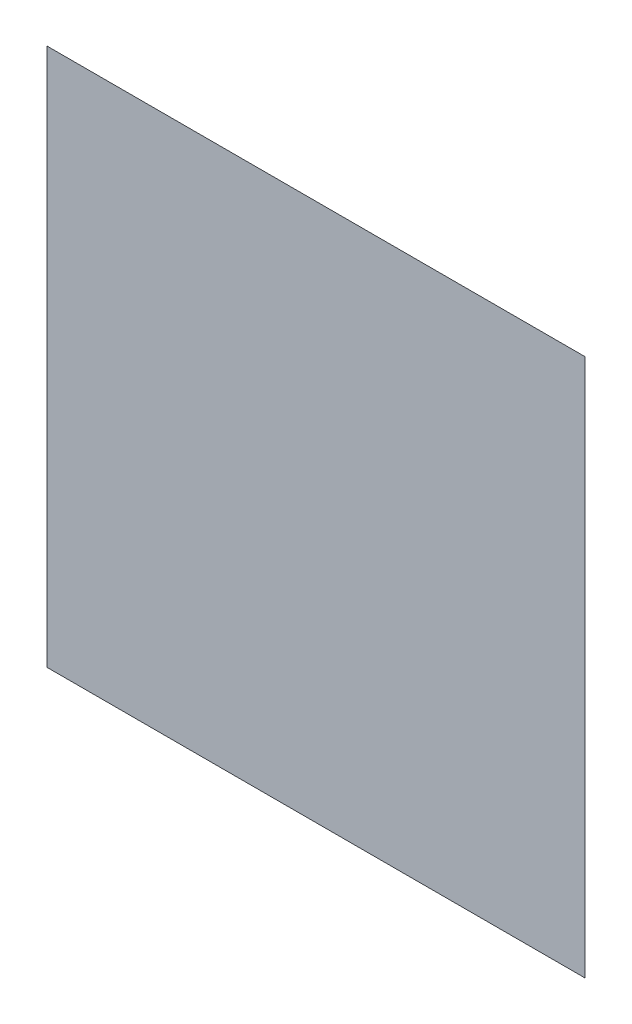
ISO-10303-21;
HEADER;
FILE_DESCRIPTION(('STEP AP214'),'2;1');
FILE_NAME('part.step','',(''),(''),'','','');
FILE_SCHEMA(('AUTOMOTIVE_DESIGN { 1 0 10303 214 1 1 1 1 }'));
ENDSEC;
DATA;
#1=APPLICATION_CONTEXT('core data for automotive mechanical design processes');
#2=APPLICATION_PROTOCOL_DEFINITION('international standard','automotive_design',2000,#1);
#3=PRODUCT_CONTEXT('',#1,'mechanical');
#4=PRODUCT('Part','Part','',(#3));
#5=PRODUCT_RELATED_PRODUCT_CATEGORY('part','',(#4));
#6=PRODUCT_DEFINITION_FORMATION('','',#4);
#7=PRODUCT_DEFINITION_CONTEXT('part definition',#1,'design');
#8=PRODUCT_DEFINITION('design','',#6,#7);
#9=PRODUCT_DEFINITION_SHAPE('','',#8);
#10=(LENGTH_UNIT() NAMED_UNIT(*) SI_UNIT(.MILLI.,.METRE.));
#11=(NAMED_UNIT(*) PLANE_ANGLE_UNIT() SI_UNIT($,.RADIAN.));
#12=(NAMED_UNIT(*) SI_UNIT($,.STERADIAN.) SOLID_ANGLE_UNIT());
#13=UNCERTAINTY_MEASURE_WITH_UNIT(LENGTH_MEASURE(1.E-05),#10,'distance_accuracy_value','');
#14=(GEOMETRIC_REPRESENTATION_CONTEXT(3) GLOBAL_UNCERTAINTY_ASSIGNED_CONTEXT((#13)) GLOBAL_UNIT_ASSIGNED_CONTEXT((#10,
#11,#12)) REPRESENTATION_CONTEXT('',''));
#15=CARTESIAN_POINT('',(0.,0.,0.));
#16=DIRECTION('',(0.,0.,1.));
#17=DIRECTION('',(1.,0.,0.));
#18=AXIS2_PLACEMENT_3D('',#15,#16,#17);
#19=CARTESIAN_POINT('',(0.,0.,0.));
#20=DIRECTION('',(0.,0.,1.));
#21=DIRECTION('',(1.,0.,0.));
#22=AXIS2_PLACEMENT_3D('',#19,#20,#21);
#23=PLANE('',#22);
#24=DIRECTION('',(0.,-1.,0.));
#25=VECTOR('',#24,1.);
#26=CARTESIAN_POINT('',(-22.2639320225002,12.25,0.));
#27=LINE('',#26,#25);
#28=CARTESIAN_POINT('',(-22.2639320225002,22.2639320225002,0.));
#29=VERTEX_POINT('',#28);
#30=CARTESIAN_POINT('',(-22.2639320225002,-22.2639320225002,0.));
#31=VERTEX_POINT('',#30);
#32=EDGE_CURVE('E66',#29,#31,#27,.T.);
#33=ORIENTED_EDGE('',*,*,#32,.F.);
#34=DIRECTION('',(-1.,0.,0.));
#35=VECTOR('',#34,1.);
#36=CARTESIAN_POINT('',(12.25,22.2639320225002,0.));
#37=LINE('',#36,#35);
#38=CARTESIAN_POINT('',(22.2639320225002,22.2639320225002,0.));
#39=VERTEX_POINT('',#38);
#40=EDGE_CURVE('E62',#39,#29,#37,.T.);
#41=ORIENTED_EDGE('',*,*,#40,.F.);
#42=DIRECTION('',(0.,1.,0.));
#43=VECTOR('',#42,1.);
#44=CARTESIAN_POINT('',(22.2639320225002,-12.25,0.));
#45=LINE('',#44,#43);
#46=CARTESIAN_POINT('',(22.2639320225002,-22.2639320225002,0.));
#47=VERTEX_POINT('',#46);
#48=EDGE_CURVE('E65',#47,#39,#45,.T.);
#49=ORIENTED_EDGE('',*,*,#48,.F.);
#50=DIRECTION('',(1.,0.,0.));
#51=VECTOR('',#50,1.);
#52=CARTESIAN_POINT('',(-12.25,-22.2639320225002,0.));
#53=LINE('',#52,#51);
#54=EDGE_CURVE('E74',#31,#47,#53,.T.);
#55=ORIENTED_EDGE('',*,*,#54,.F.);
#56=EDGE_LOOP('',(#33,#41,#49,#55));
#57=FACE_BOUND('',#56,.T.);
#58=ADVANCED_FACE('F16',(#57),#23,.F.);
#59=CARTESIAN_POINT('',(12.25,22.2639320225002,3.));
#60=DIRECTION('',(-1.,0.,0.));
#61=DIRECTION('',(0.,-1.,0.));
#62=AXIS2_PLACEMENT_3D('',#59,#60,#61);
#63=CYLINDRICAL_SURFACE('',#62,3.);
#64=CARTESIAN_POINT('',(-22.2639320225002,22.2639320225002,3.));
#65=DIRECTION('',(-0.707106781186548,-0.707106781186547,0.));
#66=DIRECTION('',(0.707106781186547,-0.707106781186547,0.));
#67=AXIS2_PLACEMENT_3D('',#64,#65,#66);
#68=ELLIPSE('',#67,4.24264068711929,3.);
#69=CARTESIAN_POINT('',(-24.5,24.5,1.));
#70=VERTEX_POINT('',#69);
#71=EDGE_CURVE('E19',#70,#29,#68,.T.);
#72=ORIENTED_EDGE('',*,*,#71,.F.);
#73=DIRECTION('',(1.,0.,0.));
#74=VECTOR('',#73,1.);
#75=CARTESIAN_POINT('',(0.,24.5,1.));
#76=LINE('',#75,#74);
#77=CARTESIAN_POINT('',(24.5,24.5,1.));
#78=VERTEX_POINT('',#77);
#79=EDGE_CURVE('E56',#78,#70,#76,.F.);
#80=ORIENTED_EDGE('',*,*,#79,.F.);
#81=CARTESIAN_POINT('',(22.2639320225002,22.2639320225002,3.));
#82=DIRECTION('',(-0.707106781186547,0.707106781186548,0.));
#83=DIRECTION('',(0.707106781186548,0.707106781186547,0.));
#84=AXIS2_PLACEMENT_3D('',#81,#82,#83);
#85=ELLIPSE('',#84,4.24264068711929,3.);
#86=EDGE_CURVE('E68',#39,#78,#85,.F.);
#87=ORIENTED_EDGE('',*,*,#86,.F.);
#88=ORIENTED_EDGE('',*,*,#40,.T.);
#89=EDGE_LOOP('',(#72,#80,#87,#88));
#90=FACE_BOUND('',#89,.T.);
#91=ADVANCED_FACE('F69',(#90),#63,.T.);
#92=CARTESIAN_POINT('',(-22.2639320225002,12.25,3.));
#93=DIRECTION('',(0.,-1.,0.));
#94=DIRECTION('',(0.,0.,-1.));
#95=AXIS2_PLACEMENT_3D('',#92,#93,#94);
#96=CYLINDRICAL_SURFACE('',#95,3.);
#97=ORIENTED_EDGE('',*,*,#71,.T.);
#98=ORIENTED_EDGE('',*,*,#32,.T.);
#99=CARTESIAN_POINT('',(-22.2639320225002,-22.2639320225002,3.));
#100=DIRECTION('',(0.707106781186547,-0.707106781186547,0.));
#101=DIRECTION('',(0.707106781186547,0.707106781186547,0.));
#102=AXIS2_PLACEMENT_3D('',#99,#100,#101);
#103=ELLIPSE('',#102,4.24264068711929,3.);
#104=CARTESIAN_POINT('',(-24.5,-24.5,1.));
#105=VERTEX_POINT('',#104);
#106=EDGE_CURVE('E82',#105,#31,#103,.T.);
#107=ORIENTED_EDGE('',*,*,#106,.F.);
#108=DIRECTION('',(0.,1.,0.));
#109=VECTOR('',#108,1.);
#110=CARTESIAN_POINT('',(-24.5,0.,1.));
#111=LINE('',#110,#109);
#112=EDGE_CURVE('E78',#70,#105,#111,.F.);
#113=ORIENTED_EDGE('',*,*,#112,.F.);
#114=EDGE_LOOP('',(#97,#98,#107,#113));
#115=FACE_BOUND('',#114,.T.);
#116=ADVANCED_FACE('F88',(#115),#96,.T.);
#117=CARTESIAN_POINT('',(-12.25,-22.2639320225002,3.));
#118=DIRECTION('',(1.,0.,0.));
#119=DIRECTION('',(0.,0.,-1.));
#120=AXIS2_PLACEMENT_3D('',#117,#118,#119);
#121=CYLINDRICAL_SURFACE('',#120,3.);
#122=CARTESIAN_POINT('',(22.2639320225002,-22.2639320225002,3.));
#123=DIRECTION('',(0.707106781186547,0.707106781186547,0.));
#124=DIRECTION('',(-0.707106781186547,0.707106781186548,0.));
#125=AXIS2_PLACEMENT_3D('',#122,#123,#124);
#126=ELLIPSE('',#125,4.24264068711929,3.);
#127=CARTESIAN_POINT('',(24.5,-24.5,1.));
#128=VERTEX_POINT('',#127);
#129=EDGE_CURVE('E34',#128,#47,#126,.T.);
#130=ORIENTED_EDGE('',*,*,#129,.F.);
#131=DIRECTION('',(1.,0.,0.));
#132=VECTOR('',#131,1.);
#133=CARTESIAN_POINT('',(0.,-24.5,1.));
#134=LINE('',#133,#132);
#135=EDGE_CURVE('E25',#105,#128,#134,.T.);
#136=ORIENTED_EDGE('',*,*,#135,.F.);
#137=ORIENTED_EDGE('',*,*,#106,.T.);
#138=ORIENTED_EDGE('',*,*,#54,.T.);
#139=EDGE_LOOP('',(#130,#136,#137,#138));
#140=FACE_BOUND('',#139,.T.);
#141=ADVANCED_FACE('F86',(#140),#121,.T.);
#142=CARTESIAN_POINT('',(22.2639320225002,-12.25,3.));
#143=DIRECTION('',(0.,1.,0.));
#144=DIRECTION('',(-1.,0.,0.));
#145=AXIS2_PLACEMENT_3D('',#142,#143,#144);
#146=CYLINDRICAL_SURFACE('',#145,3.);
#147=ORIENTED_EDGE('',*,*,#86,.T.);
#148=DIRECTION('',(0.,1.,0.));
#149=VECTOR('',#148,1.);
#150=CARTESIAN_POINT('',(24.5,0.,1.));
#151=LINE('',#150,#149);
#152=EDGE_CURVE('E11',#128,#78,#151,.T.);
#153=ORIENTED_EDGE('',*,*,#152,.F.);
#154=ORIENTED_EDGE('',*,*,#129,.T.);
#155=ORIENTED_EDGE('',*,*,#48,.T.);
#156=EDGE_LOOP('',(#147,#153,#154,#155));
#157=FACE_BOUND('',#156,.T.);
#158=ADVANCED_FACE('F72',(#157),#146,.T.);
#159=CARTESIAN_POINT('',(0.,0.,1.));
#160=DIRECTION('',(0.,0.,1.));
#161=DIRECTION('',(1.,0.,0.));
#162=AXIS2_PLACEMENT_3D('',#159,#160,#161);
#163=PLANE('',#162);
#164=ORIENTED_EDGE('',*,*,#135,.T.);
#165=ORIENTED_EDGE('',*,*,#152,.T.);
#166=ORIENTED_EDGE('',*,*,#79,.T.);
#167=ORIENTED_EDGE('',*,*,#112,.T.);
#168=EDGE_LOOP('',(#164,#165,#166,#167));
#169=FACE_BOUND('',#168,.T.);
#170=ADVANCED_FACE('F90',(#169),#163,.T.);
#171=CLOSED_SHELL('',(#58,#91,#116,#141,#158,#170));
#172=MANIFOLD_SOLID_BREP('B1',#171);
#173=ADVANCED_BREP_SHAPE_REPRESENTATION('',(#18,#172),#14);
#174=SHAPE_DEFINITION_REPRESENTATION(#9,#173);
ENDSEC;
END-ISO-10303-21;
